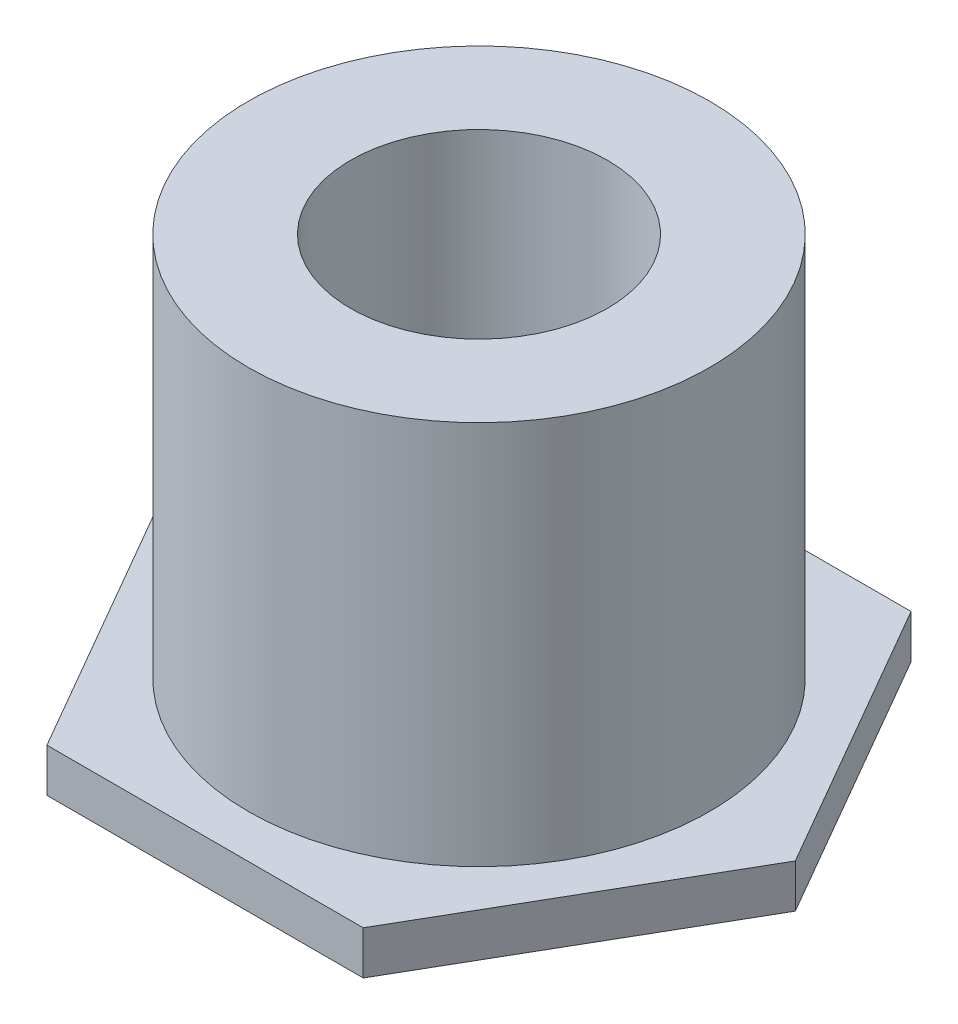
ISO-10303-21;
HEADER;
FILE_DESCRIPTION(('STEP AP214'),'2;1');
FILE_NAME('part.step','',(''),(''),'','','');
FILE_SCHEMA(('AUTOMOTIVE_DESIGN { 1 0 10303 214 1 1 1 1 }'));
ENDSEC;
DATA;
#1=APPLICATION_CONTEXT('core data for automotive mechanical design processes');
#2=APPLICATION_PROTOCOL_DEFINITION('international standard','automotive_design',2000,#1);
#3=PRODUCT_CONTEXT('',#1,'mechanical');
#4=PRODUCT('Part','Part','',(#3));
#5=PRODUCT_RELATED_PRODUCT_CATEGORY('part','',(#4));
#6=PRODUCT_DEFINITION_FORMATION('','',#4);
#7=PRODUCT_DEFINITION_CONTEXT('part definition',#1,'design');
#8=PRODUCT_DEFINITION('design','',#6,#7);
#9=PRODUCT_DEFINITION_SHAPE('','',#8);
#10=(LENGTH_UNIT() NAMED_UNIT(*) SI_UNIT(.MILLI.,.METRE.));
#11=(NAMED_UNIT(*) PLANE_ANGLE_UNIT() SI_UNIT($,.RADIAN.));
#12=(NAMED_UNIT(*) SI_UNIT($,.STERADIAN.) SOLID_ANGLE_UNIT());
#13=UNCERTAINTY_MEASURE_WITH_UNIT(LENGTH_MEASURE(1.E-05),#10,'distance_accuracy_value','');
#14=(GEOMETRIC_REPRESENTATION_CONTEXT(3) GLOBAL_UNCERTAINTY_ASSIGNED_CONTEXT((#13)) GLOBAL_UNIT_ASSIGNED_CONTEXT((#10,
#11,#12)) REPRESENTATION_CONTEXT('',''));
#15=CARTESIAN_POINT('',(0.,0.,0.));
#16=DIRECTION('',(0.,0.,1.));
#17=DIRECTION('',(1.,0.,0.));
#18=AXIS2_PLACEMENT_3D('',#15,#16,#17);
#19=CARTESIAN_POINT('',(-1.84752086140681,0.508,3.20000000000001));
#20=DIRECTION('',(0.,0.,-1.));
#21=DIRECTION('',(-1.,0.,0.));
#22=AXIS2_PLACEMENT_3D('',#19,#20,#21);
#23=PLANE('',#22);
#24=DIRECTION('',(1.,0.,0.));
#25=VECTOR('',#24,1.);
#26=CARTESIAN_POINT('',(-1.84752086140681,0.,3.20000000000001));
#27=LINE('',#26,#25);
#28=CARTESIAN_POINT('',(-1.84752086140681,0.,3.20000000000001));
#29=VERTEX_POINT('',#28);
#30=CARTESIAN_POINT('',(1.84752086140679,0.,3.2));
#31=VERTEX_POINT('',#30);
#32=EDGE_CURVE('E118',#29,#31,#27,.T.);
#33=ORIENTED_EDGE('',*,*,#32,.T.);
#34=DIRECTION('',(0.,-1.,0.));
#35=VECTOR('',#34,1.);
#36=CARTESIAN_POINT('',(1.84752086140679,0.508,3.2));
#37=LINE('',#36,#35);
#38=CARTESIAN_POINT('',(1.84752086140679,0.508,3.2));
#39=VERTEX_POINT('',#38);
#40=EDGE_CURVE('E35',#39,#31,#37,.T.);
#41=ORIENTED_EDGE('',*,*,#40,.F.);
#42=DIRECTION('',(1.,0.,0.));
#43=VECTOR('',#42,1.);
#44=CARTESIAN_POINT('',(-1.84752086140681,0.508,3.20000000000001));
#45=LINE('',#44,#43);
#46=CARTESIAN_POINT('',(-1.84752086140681,0.508,3.20000000000001));
#47=VERTEX_POINT('',#46);
#48=EDGE_CURVE('E129',#47,#39,#45,.T.);
#49=ORIENTED_EDGE('',*,*,#48,.F.);
#50=DIRECTION('',(0.,-1.,0.));
#51=VECTOR('',#50,1.);
#52=CARTESIAN_POINT('',(-1.84752086140681,0.508,3.20000000000001));
#53=LINE('',#52,#51);
#54=EDGE_CURVE('E114',#47,#29,#53,.T.);
#55=ORIENTED_EDGE('',*,*,#54,.T.);
#56=EDGE_LOOP('',(#33,#41,#49,#55));
#57=FACE_BOUND('',#56,.T.);
#58=ADVANCED_FACE('F32',(#57),#23,.F.);
#59=CARTESIAN_POINT('',(1.84752086140679,0.508,3.2));
#60=DIRECTION('',(-0.866025403784438,0.,-0.500000000000001));
#61=DIRECTION('',(-0.500000000000001,0.,0.866025403784438));
#62=AXIS2_PLACEMENT_3D('',#59,#60,#61);
#63=PLANE('',#62);
#64=DIRECTION('',(0.500000000000001,0.,-0.866025403784438));
#65=VECTOR('',#64,1.);
#66=CARTESIAN_POINT('',(1.84752086140679,0.,3.2));
#67=LINE('',#66,#65);
#68=CARTESIAN_POINT('',(3.69504172281359,0.,0.));
#69=VERTEX_POINT('',#68);
#70=EDGE_CURVE('E121',#31,#69,#67,.T.);
#71=ORIENTED_EDGE('',*,*,#70,.T.);
#72=DIRECTION('',(0.,-1.,0.));
#73=VECTOR('',#72,1.);
#74=CARTESIAN_POINT('',(3.69504172281359,0.508,0.));
#75=LINE('',#74,#73);
#76=CARTESIAN_POINT('',(3.69504172281359,0.508,0.));
#77=VERTEX_POINT('',#76);
#78=EDGE_CURVE('E132',#77,#69,#75,.T.);
#79=ORIENTED_EDGE('',*,*,#78,.F.);
#80=DIRECTION('',(0.500000000000001,0.,-0.866025403784438));
#81=VECTOR('',#80,1.);
#82=CARTESIAN_POINT('',(1.84752086140679,0.508,3.2));
#83=LINE('',#82,#81);
#84=EDGE_CURVE('E87',#39,#77,#83,.T.);
#85=ORIENTED_EDGE('',*,*,#84,.F.);
#86=ORIENTED_EDGE('',*,*,#40,.T.);
#87=EDGE_LOOP('',(#71,#79,#85,#86));
#88=FACE_BOUND('',#87,.T.);
#89=ADVANCED_FACE('F137',(#88),#63,.F.);
#90=CARTESIAN_POINT('',(3.69504172281359,0.508,0.));
#91=DIRECTION('',(-0.866025403784439,0.,0.5));
#92=DIRECTION('',(0.5,0.,0.866025403784439));
#93=AXIS2_PLACEMENT_3D('',#90,#91,#92);
#94=PLANE('',#93);
#95=DIRECTION('',(-0.5,0.,-0.866025403784439));
#96=VECTOR('',#95,1.);
#97=CARTESIAN_POINT('',(3.69504172281359,0.,0.));
#98=LINE('',#97,#96);
#99=CARTESIAN_POINT('',(1.84752086140678,0.,-3.20000000000001));
#100=VERTEX_POINT('',#99);
#101=EDGE_CURVE('E124',#69,#100,#98,.T.);
#102=ORIENTED_EDGE('',*,*,#101,.T.);
#103=DIRECTION('',(0.,-1.,0.));
#104=VECTOR('',#103,1.);
#105=CARTESIAN_POINT('',(1.84752086140678,0.508,-3.20000000000001));
#106=LINE('',#105,#104);
#107=CARTESIAN_POINT('',(1.84752086140678,0.508,-3.20000000000001));
#108=VERTEX_POINT('',#107);
#109=EDGE_CURVE('E109',#108,#100,#106,.T.);
#110=ORIENTED_EDGE('',*,*,#109,.F.);
#111=DIRECTION('',(-0.5,0.,-0.866025403784439));
#112=VECTOR('',#111,1.);
#113=CARTESIAN_POINT('',(3.69504172281359,0.508,0.));
#114=LINE('',#113,#112);
#115=EDGE_CURVE('E100',#77,#108,#114,.T.);
#116=ORIENTED_EDGE('',*,*,#115,.F.);
#117=ORIENTED_EDGE('',*,*,#78,.T.);
#118=EDGE_LOOP('',(#102,#110,#116,#117));
#119=FACE_BOUND('',#118,.T.);
#120=ADVANCED_FACE('F143',(#119),#94,.F.);
#121=CARTESIAN_POINT('',(1.84752086140678,0.508,-3.20000000000001));
#122=DIRECTION('',(0.,0.,1.));
#123=DIRECTION('',(1.,0.,0.));
#124=AXIS2_PLACEMENT_3D('',#121,#122,#123);
#125=PLANE('',#124);
#126=DIRECTION('',(-1.,0.,0.));
#127=VECTOR('',#126,1.);
#128=CARTESIAN_POINT('',(1.84752086140678,0.,-3.20000000000001));
#129=LINE('',#128,#127);
#130=CARTESIAN_POINT('',(-1.84752086140681,0.,-3.20000000000001));
#131=VERTEX_POINT('',#130);
#132=EDGE_CURVE('E108',#100,#131,#129,.T.);
#133=ORIENTED_EDGE('',*,*,#132,.T.);
#134=DIRECTION('',(0.,-1.,0.));
#135=VECTOR('',#134,1.);
#136=CARTESIAN_POINT('',(-1.84752086140681,0.508,-3.20000000000001));
#137=LINE('',#136,#135);
#138=CARTESIAN_POINT('',(-1.84752086140681,0.508,-3.20000000000001));
#139=VERTEX_POINT('',#138);
#140=EDGE_CURVE('E105',#139,#131,#137,.T.);
#141=ORIENTED_EDGE('',*,*,#140,.F.);
#142=DIRECTION('',(-1.,0.,0.));
#143=VECTOR('',#142,1.);
#144=CARTESIAN_POINT('',(1.84752086140678,0.508,-3.20000000000001));
#145=LINE('',#144,#143);
#146=EDGE_CURVE('E94',#108,#139,#145,.T.);
#147=ORIENTED_EDGE('',*,*,#146,.F.);
#148=ORIENTED_EDGE('',*,*,#109,.T.);
#149=EDGE_LOOP('',(#133,#141,#147,#148));
#150=FACE_BOUND('',#149,.T.);
#151=ADVANCED_FACE('F106',(#150),#125,.F.);
#152=CARTESIAN_POINT('',(-1.84752086140681,0.508,-3.20000000000001));
#153=DIRECTION('',(0.866025403784439,0.,0.5));
#154=DIRECTION('',(0.5,0.,-0.866025403784439));
#155=AXIS2_PLACEMENT_3D('',#152,#153,#154);
#156=PLANE('',#155);
#157=DIRECTION('',(-0.5,0.,0.866025403784439));
#158=VECTOR('',#157,1.);
#159=CARTESIAN_POINT('',(-1.84752086140681,0.,-3.20000000000001));
#160=LINE('',#159,#158);
#161=CARTESIAN_POINT('',(-3.69504172281362,0.,0.));
#162=VERTEX_POINT('',#161);
#163=EDGE_CURVE('E72',#131,#162,#160,.T.);
#164=ORIENTED_EDGE('',*,*,#163,.T.);
#165=DIRECTION('',(0.,-1.,0.));
#166=VECTOR('',#165,1.);
#167=CARTESIAN_POINT('',(-3.69504172281362,0.508,0.));
#168=LINE('',#167,#166);
#169=CARTESIAN_POINT('',(-3.69504172281362,0.508,0.));
#170=VERTEX_POINT('',#169);
#171=EDGE_CURVE('E110',#170,#162,#168,.T.);
#172=ORIENTED_EDGE('',*,*,#171,.F.);
#173=DIRECTION('',(-0.5,0.,0.866025403784439));
#174=VECTOR('',#173,1.);
#175=CARTESIAN_POINT('',(-1.84752086140681,0.508,-3.20000000000001));
#176=LINE('',#175,#174);
#177=EDGE_CURVE('E98',#139,#170,#176,.T.);
#178=ORIENTED_EDGE('',*,*,#177,.F.);
#179=ORIENTED_EDGE('',*,*,#140,.T.);
#180=EDGE_LOOP('',(#164,#172,#178,#179));
#181=FACE_BOUND('',#180,.T.);
#182=ADVANCED_FACE('F112',(#181),#156,.F.);
#183=CARTESIAN_POINT('',(-3.69504172281362,0.508,0.));
#184=DIRECTION('',(0.866025403784439,0.,-0.5));
#185=DIRECTION('',(-0.5,0.,-0.866025403784439));
#186=AXIS2_PLACEMENT_3D('',#183,#184,#185);
#187=PLANE('',#186);
#188=DIRECTION('',(0.5,0.,0.866025403784439));
#189=VECTOR('',#188,1.);
#190=CARTESIAN_POINT('',(-3.69504172281362,0.,0.));
#191=LINE('',#190,#189);
#192=EDGE_CURVE('E78',#162,#29,#191,.T.);
#193=ORIENTED_EDGE('',*,*,#192,.T.);
#194=ORIENTED_EDGE('',*,*,#54,.F.);
#195=DIRECTION('',(0.5,0.,0.866025403784439));
#196=VECTOR('',#195,1.);
#197=CARTESIAN_POINT('',(-3.69504172281362,0.508,0.));
#198=LINE('',#197,#196);
#199=EDGE_CURVE('E49',#170,#47,#198,.T.);
#200=ORIENTED_EDGE('',*,*,#199,.F.);
#201=ORIENTED_EDGE('',*,*,#171,.T.);
#202=EDGE_LOOP('',(#193,#194,#200,#201));
#203=FACE_BOUND('',#202,.T.);
#204=ADVANCED_FACE('F186',(#203),#187,.F.);
#205=CARTESIAN_POINT('',(1.84752086140679,0.508,3.2));
#206=DIRECTION('',(0.,1.,0.));
#207=DIRECTION('',(0.,0.,1.));
#208=AXIS2_PLACEMENT_3D('',#205,#206,#207);
#209=PLANE('',#208);
#210=CARTESIAN_POINT('',(0.,0.508,0.));
#211=DIRECTION('',(0.,1.,0.));
#212=DIRECTION('',(0.,0.,1.));
#213=AXIS2_PLACEMENT_3D('',#210,#211,#212);
#214=CIRCLE('',#213,2.695);
#215=CARTESIAN_POINT('',(0.,0.508,2.695));
#216=VERTEX_POINT('',#215);
#217=EDGE_CURVE('E11',#216,#216,#214,.T.);
#218=ORIENTED_EDGE('',*,*,#217,.F.);
#219=EDGE_LOOP('',(#218));
#220=FACE_BOUND('',#219,.T.);
#221=ORIENTED_EDGE('',*,*,#48,.T.);
#222=ORIENTED_EDGE('',*,*,#84,.T.);
#223=ORIENTED_EDGE('',*,*,#115,.T.);
#224=ORIENTED_EDGE('',*,*,#146,.T.);
#225=ORIENTED_EDGE('',*,*,#177,.T.);
#226=ORIENTED_EDGE('',*,*,#199,.T.);
#227=EDGE_LOOP('',(#221,#222,#223,#224,#225,#226));
#228=FACE_BOUND('',#227,.T.);
#229=ADVANCED_FACE('F96',(#220,#228),#209,.T.);
#230=CARTESIAN_POINT('',(1.84752086140679,0.,3.2));
#231=DIRECTION('',(0.,1.,0.));
#232=DIRECTION('',(0.,0.,1.));
#233=AXIS2_PLACEMENT_3D('',#230,#231,#232);
#234=PLANE('',#233);
#235=ORIENTED_EDGE('',*,*,#32,.F.);
#236=ORIENTED_EDGE('',*,*,#192,.F.);
#237=ORIENTED_EDGE('',*,*,#163,.F.);
#238=ORIENTED_EDGE('',*,*,#132,.F.);
#239=ORIENTED_EDGE('',*,*,#101,.F.);
#240=ORIENTED_EDGE('',*,*,#70,.F.);
#241=EDGE_LOOP('',(#235,#236,#237,#238,#239,#240));
#242=FACE_BOUND('',#241,.T.);
#243=ADVANCED_FACE('F142',(#242),#234,.F.);
#244=CARTESIAN_POINT('',(0.,5.,0.));
#245=DIRECTION('',(0.,-1.,0.));
#246=DIRECTION('',(0.,0.,-1.));
#247=AXIS2_PLACEMENT_3D('',#244,#245,#246);
#248=CYLINDRICAL_SURFACE('',#247,2.695);
#249=ORIENTED_EDGE('',*,*,#217,.T.);
#250=EDGE_LOOP('',(#249));
#251=FACE_BOUND('',#250,.T.);
#252=CARTESIAN_POINT('',(0.,5.,0.));
#253=DIRECTION('',(0.,-1.,0.));
#254=DIRECTION('',(0.,0.,-1.));
#255=AXIS2_PLACEMENT_3D('',#252,#253,#254);
#256=CIRCLE('',#255,2.695);
#257=CARTESIAN_POINT('',(0.,5.,-2.695));
#258=VERTEX_POINT('',#257);
#259=EDGE_CURVE('E149',#258,#258,#256,.T.);
#260=ORIENTED_EDGE('',*,*,#259,.T.);
#261=EDGE_LOOP('',(#260));
#262=FACE_BOUND('',#261,.T.);
#263=ADVANCED_FACE('F170',(#251,#262),#248,.T.);
#264=CARTESIAN_POINT('',(0.,5.,0.));
#265=DIRECTION('',(0.,-1.,0.));
#266=DIRECTION('',(0.,0.,-1.));
#267=AXIS2_PLACEMENT_3D('',#264,#265,#266);
#268=PLANE('',#267);
#269=CARTESIAN_POINT('',(0.,5.,0.));
#270=DIRECTION('',(0.,-1.,0.));
#271=DIRECTION('',(0.,0.,-1.));
#272=AXIS2_PLACEMENT_3D('',#269,#270,#271);
#273=CIRCLE('',#272,1.5);
#274=CARTESIAN_POINT('',(0.,5.,-1.5));
#275=VERTEX_POINT('',#274);
#276=EDGE_CURVE('E152',#275,#275,#273,.T.);
#277=ORIENTED_EDGE('',*,*,#276,.T.);
#278=EDGE_LOOP('',(#277));
#279=FACE_BOUND('',#278,.T.);
#280=ORIENTED_EDGE('',*,*,#259,.F.);
#281=EDGE_LOOP('',(#280));
#282=FACE_BOUND('',#281,.T.);
#283=ADVANCED_FACE('F156',(#279,#282),#268,.F.);
#284=CARTESIAN_POINT('',(0.,5.,0.));
#285=DIRECTION('',(0.,-1.,0.));
#286=DIRECTION('',(0.,0.,-1.));
#287=AXIS2_PLACEMENT_3D('',#284,#285,#286);
#288=CYLINDRICAL_SURFACE('',#287,1.5);
#289=CARTESIAN_POINT('',(0.,0.508,0.));
#290=DIRECTION('',(0.,1.,0.));
#291=DIRECTION('',(0.,0.,1.));
#292=AXIS2_PLACEMENT_3D('',#289,#290,#291);
#293=CIRCLE('',#292,1.5);
#294=CARTESIAN_POINT('',(0.,0.508,1.5));
#295=VERTEX_POINT('',#294);
#296=EDGE_CURVE('E122',#295,#295,#293,.T.);
#297=ORIENTED_EDGE('',*,*,#296,.F.);
#298=EDGE_LOOP('',(#297));
#299=FACE_BOUND('',#298,.T.);
#300=ORIENTED_EDGE('',*,*,#276,.F.);
#301=EDGE_LOOP('',(#300));
#302=FACE_BOUND('',#301,.T.);
#303=ADVANCED_FACE('F159',(#299,#302),#288,.F.);
#304=ORIENTED_EDGE('',*,*,#296,.T.);
#305=EDGE_LOOP('',(#304));
#306=FACE_BOUND('',#305,.T.);
#307=ADVANCED_FACE('F161',(#306),#209,.T.);
#308=CLOSED_SHELL('',(#58,#89,#120,#151,#182,#204,#229,#243,#263,#283,#303,#307));
#309=MANIFOLD_SOLID_BREP('B2',#308);
#310=ADVANCED_BREP_SHAPE_REPRESENTATION('',(#18,#309),#14);
#311=SHAPE_DEFINITION_REPRESENTATION(#9,#310);
ENDSEC;
END-ISO-10303-21;
